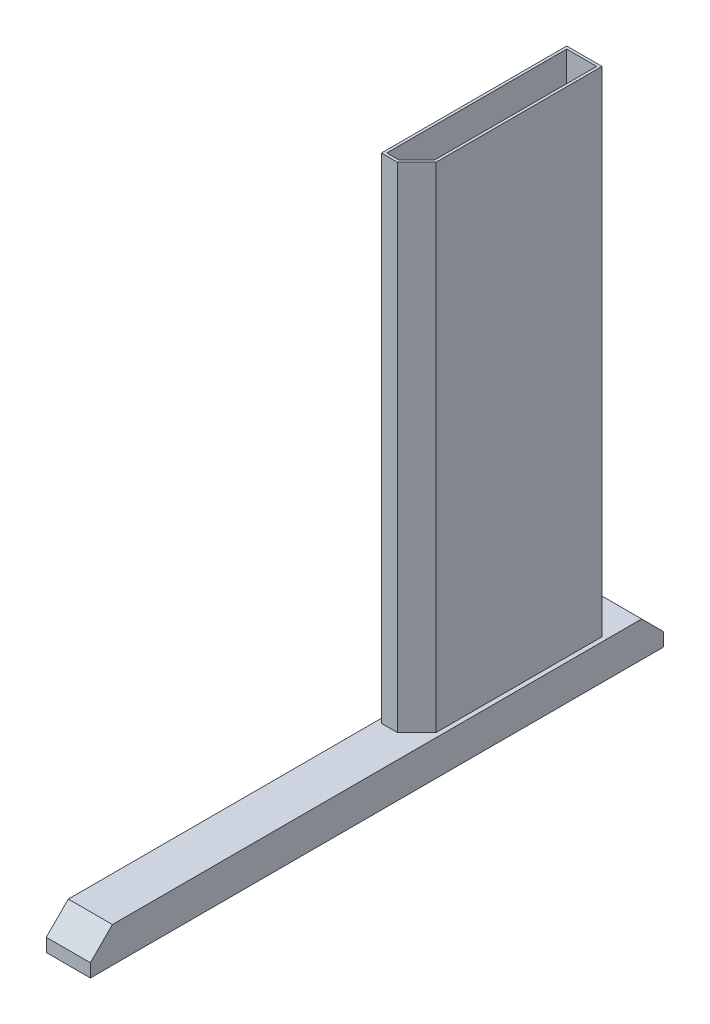
ISO-10303-21;
HEADER;
FILE_DESCRIPTION(('STEP AP214'),'2;1');
FILE_NAME('part.step','',(''),(''),'','','');
FILE_SCHEMA(('AUTOMOTIVE_DESIGN { 1 0 10303 214 1 1 1 1 }'));
ENDSEC;
DATA;
#1=APPLICATION_CONTEXT('core data for automotive mechanical design processes');
#2=APPLICATION_PROTOCOL_DEFINITION('international standard','automotive_design',2000,#1);
#3=PRODUCT_CONTEXT('',#1,'mechanical');
#4=PRODUCT('Part','Part','',(#3));
#5=PRODUCT_RELATED_PRODUCT_CATEGORY('part','',(#4));
#6=PRODUCT_DEFINITION_FORMATION('','',#4);
#7=PRODUCT_DEFINITION_CONTEXT('part definition',#1,'design');
#8=PRODUCT_DEFINITION('design','',#6,#7);
#9=PRODUCT_DEFINITION_SHAPE('','',#8);
#10=(LENGTH_UNIT() NAMED_UNIT(*) SI_UNIT(.MILLI.,.METRE.));
#11=(NAMED_UNIT(*) PLANE_ANGLE_UNIT() SI_UNIT($,.RADIAN.));
#12=(NAMED_UNIT(*) SI_UNIT($,.STERADIAN.) SOLID_ANGLE_UNIT());
#13=UNCERTAINTY_MEASURE_WITH_UNIT(LENGTH_MEASURE(1.E-05),#10,'distance_accuracy_value','');
#14=(GEOMETRIC_REPRESENTATION_CONTEXT(3) GLOBAL_UNCERTAINTY_ASSIGNED_CONTEXT((#13)) GLOBAL_UNIT_ASSIGNED_CONTEXT((#10,
#11,#12)) REPRESENTATION_CONTEXT('',''));
#15=CARTESIAN_POINT('',(0.,0.,0.));
#16=DIRECTION('',(0.,0.,1.));
#17=DIRECTION('',(1.,0.,0.));
#18=AXIS2_PLACEMENT_3D('',#15,#16,#17);
#19=CARTESIAN_POINT('',(50.,40.,300.));
#20=DIRECTION('',(0.,-1.,0.));
#21=DIRECTION('',(0.,0.,-1.));
#22=AXIS2_PLACEMENT_3D('',#19,#20,#21);
#23=PLANE('',#22);
#24=DIRECTION('',(0.,0.,-1.));
#25=VECTOR('',#24,1.);
#26=CARTESIAN_POINT('',(8.,40.,-50.));
#27=LINE('',#26,#25);
#28=CARTESIAN_POINT('',(8.,40.,-53.));
#29=VERTEX_POINT('',#28);
#30=CARTESIAN_POINT('',(8.,40.,-257.));
#31=VERTEX_POINT('',#30);
#32=EDGE_CURVE('E306',#29,#31,#27,.T.);
#33=ORIENTED_EDGE('',*,*,#32,.F.);
#34=DIRECTION('',(1.,0.,0.));
#35=VECTOR('',#34,1.);
#36=CARTESIAN_POINT('',(22.9289321881345,40.,-53.));
#37=LINE('',#36,#35);
#38=CARTESIAN_POINT('',(21.6862915010152,39.9999999999999,-53.));
#39=VERTEX_POINT('',#38);
#40=EDGE_CURVE('E318',#39,#29,#37,.F.);
#41=ORIENTED_EDGE('',*,*,#40,.F.);
#42=DIRECTION('',(-0.707106781186546,0.,0.707106781186549));
#43=VECTOR('',#42,1.);
#44=CARTESIAN_POINT('',(42.8786796564404,39.9999999999998,-74.1923881554252));
#45=LINE('',#44,#43);
#46=CARTESIAN_POINT('',(42.,39.9999999999999,-73.3137084989848));
#47=VERTEX_POINT('',#46);
#48=EDGE_CURVE('E137',#47,#39,#45,.T.);
#49=ORIENTED_EDGE('',*,*,#48,.F.);
#50=DIRECTION('',(0.,0.,1.));
#51=VECTOR('',#50,1.);
#52=CARTESIAN_POINT('',(42.,40.,-260.));
#53=LINE('',#52,#51);
#54=CARTESIAN_POINT('',(42.,40.,-257.));
#55=VERTEX_POINT('',#54);
#56=EDGE_CURVE('E131',#55,#47,#53,.T.);
#57=ORIENTED_EDGE('',*,*,#56,.F.);
#58=DIRECTION('',(1.,0.,0.));
#59=VECTOR('',#58,1.);
#60=CARTESIAN_POINT('',(5.,40.,-257.));
#61=LINE('',#60,#59);
#62=EDGE_CURVE('E310',#31,#55,#61,.T.);
#63=ORIENTED_EDGE('',*,*,#62,.F.);
#64=EDGE_LOOP('',(#33,#41,#49,#57,#63));
#65=FACE_BOUND('',#64,.T.);
#66=ADVANCED_FACE('F18',(#65),#23,.F.);
#67=CARTESIAN_POINT('',(50.,0.,325.));
#68=DIRECTION('',(0.,0.,-1.));
#69=DIRECTION('',(-1.,0.,0.));
#70=AXIS2_PLACEMENT_3D('',#67,#68,#69);
#71=PLANE('',#70);
#72=DIRECTION('',(1.,0.,0.));
#73=VECTOR('',#72,1.);
#74=CARTESIAN_POINT('',(50.,0.,325.));
#75=LINE('',#74,#73);
#76=CARTESIAN_POINT('',(0.,0.,325.));
#77=VERTEX_POINT('',#76);
#78=CARTESIAN_POINT('',(50.,0.,325.));
#79=VERTEX_POINT('',#78);
#80=EDGE_CURVE('E21',#77,#79,#75,.T.);
#81=ORIENTED_EDGE('',*,*,#80,.T.);
#82=DIRECTION('',(0.,1.,0.));
#83=VECTOR('',#82,1.);
#84=CARTESIAN_POINT('',(50.,40.,325.));
#85=LINE('',#84,#83);
#86=CARTESIAN_POINT('',(50.,15.,325.));
#87=VERTEX_POINT('',#86);
#88=EDGE_CURVE('E288',#79,#87,#85,.T.);
#89=ORIENTED_EDGE('',*,*,#88,.T.);
#90=DIRECTION('',(1.,0.,0.));
#91=VECTOR('',#90,1.);
#92=CARTESIAN_POINT('',(50.,15.,325.));
#93=LINE('',#92,#91);
#94=CARTESIAN_POINT('',(0.,15.,325.));
#95=VERTEX_POINT('',#94);
#96=EDGE_CURVE('E282',#87,#95,#93,.F.);
#97=ORIENTED_EDGE('',*,*,#96,.T.);
#98=DIRECTION('',(0.,1.,0.));
#99=VECTOR('',#98,1.);
#100=CARTESIAN_POINT('',(0.,40.,325.));
#101=LINE('',#100,#99);
#102=EDGE_CURVE('E280',#77,#95,#101,.T.);
#103=ORIENTED_EDGE('',*,*,#102,.F.);
#104=EDGE_LOOP('',(#81,#89,#97,#103));
#105=FACE_BOUND('',#104,.T.);
#106=ADVANCED_FACE('F456',(#105),#71,.F.);
#107=CARTESIAN_POINT('',(50.,15.,-325.));
#108=DIRECTION('',(0.,0.,1.));
#109=DIRECTION('',(1.,0.,0.));
#110=AXIS2_PLACEMENT_3D('',#107,#108,#109);
#111=PLANE('',#110);
#112=DIRECTION('',(1.,0.,0.));
#113=VECTOR('',#112,1.);
#114=CARTESIAN_POINT('',(50.,15.,-325.));
#115=LINE('',#114,#113);
#116=CARTESIAN_POINT('',(0.,15.,-325.));
#117=VERTEX_POINT('',#116);
#118=CARTESIAN_POINT('',(50.,15.,-325.));
#119=VERTEX_POINT('',#118);
#120=EDGE_CURVE('E299',#117,#119,#115,.T.);
#121=ORIENTED_EDGE('',*,*,#120,.T.);
#122=DIRECTION('',(0.,1.,0.));
#123=VECTOR('',#122,1.);
#124=CARTESIAN_POINT('',(50.,40.,-325.));
#125=LINE('',#124,#123);
#126=CARTESIAN_POINT('',(50.,0.,-325.));
#127=VERTEX_POINT('',#126);
#128=EDGE_CURVE('E293',#119,#127,#125,.F.);
#129=ORIENTED_EDGE('',*,*,#128,.T.);
#130=DIRECTION('',(1.,0.,0.));
#131=VECTOR('',#130,1.);
#132=CARTESIAN_POINT('',(50.,0.,-325.));
#133=LINE('',#132,#131);
#134=CARTESIAN_POINT('',(0.,0.,-325.));
#135=VERTEX_POINT('',#134);
#136=EDGE_CURVE('E319',#127,#135,#133,.F.);
#137=ORIENTED_EDGE('',*,*,#136,.T.);
#138=DIRECTION('',(0.,1.,0.));
#139=VECTOR('',#138,1.);
#140=CARTESIAN_POINT('',(0.,40.,-325.));
#141=LINE('',#140,#139);
#142=EDGE_CURVE('E273',#117,#135,#141,.F.);
#143=ORIENTED_EDGE('',*,*,#142,.F.);
#144=EDGE_LOOP('',(#121,#129,#137,#143));
#145=FACE_BOUND('',#144,.T.);
#146=ADVANCED_FACE('F453',(#145),#111,.F.);
#147=CARTESIAN_POINT('',(50.,0.,325.));
#148=DIRECTION('',(0.,1.,0.));
#149=DIRECTION('',(0.,0.,1.));
#150=AXIS2_PLACEMENT_3D('',#147,#148,#149);
#151=PLANE('',#150);
#152=ORIENTED_EDGE('',*,*,#136,.F.);
#153=DIRECTION('',(0.,0.,1.));
#154=VECTOR('',#153,1.);
#155=CARTESIAN_POINT('',(50.,0.,325.));
#156=LINE('',#155,#154);
#157=EDGE_CURVE('E290',#127,#79,#156,.T.);
#158=ORIENTED_EDGE('',*,*,#157,.T.);
#159=ORIENTED_EDGE('',*,*,#80,.F.);
#160=DIRECTION('',(0.,0.,1.));
#161=VECTOR('',#160,1.);
#162=CARTESIAN_POINT('',(0.,0.,325.));
#163=LINE('',#162,#161);
#164=EDGE_CURVE('E270',#135,#77,#163,.T.);
#165=ORIENTED_EDGE('',*,*,#164,.F.);
#166=EDGE_LOOP('',(#152,#158,#159,#165));
#167=FACE_BOUND('',#166,.T.);
#168=ADVANCED_FACE('F449',(#167),#151,.F.);
#169=CARTESIAN_POINT('',(22.9289321881345,600.,-53.));
#170=DIRECTION('',(0.,0.,-1.));
#171=DIRECTION('',(0.,1.,0.));
#172=AXIS2_PLACEMENT_3D('',#169,#170,#171);
#173=PLANE('',#172);
#174=DIRECTION('',(1.,0.,0.));
#175=VECTOR('',#174,1.);
#176=CARTESIAN_POINT('',(5.,600.,-53.));
#177=LINE('',#176,#175);
#178=CARTESIAN_POINT('',(8.,600.,-53.));
#179=VERTEX_POINT('',#178);
#180=CARTESIAN_POINT('',(21.6862915010152,600.,-53.));
#181=VERTEX_POINT('',#180);
#182=EDGE_CURVE('E255',#179,#181,#177,.T.);
#183=ORIENTED_EDGE('',*,*,#182,.T.);
#184=DIRECTION('',(0.,1.,0.));
#185=VECTOR('',#184,1.);
#186=CARTESIAN_POINT('',(21.6862915010152,600.,-53.));
#187=LINE('',#186,#185);
#188=EDGE_CURVE('E315',#39,#181,#187,.T.);
#189=ORIENTED_EDGE('',*,*,#188,.F.);
#190=ORIENTED_EDGE('',*,*,#40,.T.);
#191=DIRECTION('',(0.,1.,0.));
#192=VECTOR('',#191,1.);
#193=CARTESIAN_POINT('',(8.,600.,-53.));
#194=LINE('',#193,#192);
#195=EDGE_CURVE('E301',#179,#29,#194,.F.);
#196=ORIENTED_EDGE('',*,*,#195,.F.);
#197=EDGE_LOOP('',(#183,#189,#190,#196));
#198=FACE_BOUND('',#197,.T.);
#199=ADVANCED_FACE('F446',(#198),#173,.T.);
#200=CARTESIAN_POINT('',(42.8786796564404,600.,-74.1923881554252));
#201=DIRECTION('',(-0.707106781186549,0.,-0.707106781186546));
#202=DIRECTION('',(-0.707106781186546,0.,0.707106781186549));
#203=AXIS2_PLACEMENT_3D('',#200,#201,#202);
#204=PLANE('',#203);
#205=DIRECTION('',(0.707106781186546,0.,-0.707106781186549));
#206=VECTOR('',#205,1.);
#207=CARTESIAN_POINT('',(21.6862915010152,600.,-53.));
#208=LINE('',#207,#206);
#209=CARTESIAN_POINT('',(42.,600.,-73.3137084989848));
#210=VERTEX_POINT('',#209);
#211=EDGE_CURVE('E252',#181,#210,#208,.T.);
#212=ORIENTED_EDGE('',*,*,#211,.T.);
#213=DIRECTION('',(0.,1.,0.));
#214=VECTOR('',#213,1.);
#215=CARTESIAN_POINT('',(42.,600.,-73.3137084989848));
#216=LINE('',#215,#214);
#217=EDGE_CURVE('E312',#47,#210,#216,.T.);
#218=ORIENTED_EDGE('',*,*,#217,.F.);
#219=ORIENTED_EDGE('',*,*,#48,.T.);
#220=ORIENTED_EDGE('',*,*,#188,.T.);
#221=EDGE_LOOP('',(#212,#218,#219,#220));
#222=FACE_BOUND('',#221,.T.);
#223=ADVANCED_FACE('F443',(#222),#204,.T.);
#224=CARTESIAN_POINT('',(42.,600.,-260.));
#225=DIRECTION('',(-1.,0.,0.));
#226=DIRECTION('',(0.,0.,1.));
#227=AXIS2_PLACEMENT_3D('',#224,#225,#226);
#228=PLANE('',#227);
#229=DIRECTION('',(0.,0.,-1.));
#230=VECTOR('',#229,1.);
#231=CARTESIAN_POINT('',(42.,600.,-260.));
#232=LINE('',#231,#230);
#233=CARTESIAN_POINT('',(42.,600.,-257.));
#234=VERTEX_POINT('',#233);
#235=EDGE_CURVE('E249',#210,#234,#232,.T.);
#236=ORIENTED_EDGE('',*,*,#235,.T.);
#237=DIRECTION('',(0.,-1.,0.));
#238=VECTOR('',#237,1.);
#239=CARTESIAN_POINT('',(42.,600.,-257.));
#240=LINE('',#239,#238);
#241=EDGE_CURVE('E308',#55,#234,#240,.F.);
#242=ORIENTED_EDGE('',*,*,#241,.F.);
#243=ORIENTED_EDGE('',*,*,#56,.T.);
#244=ORIENTED_EDGE('',*,*,#217,.T.);
#245=EDGE_LOOP('',(#236,#242,#243,#244));
#246=FACE_BOUND('',#245,.T.);
#247=ADVANCED_FACE('F439',(#246),#228,.T.);
#248=CARTESIAN_POINT('',(5.,600.,-257.));
#249=DIRECTION('',(0.,0.,1.));
#250=DIRECTION('',(0.,-1.,0.));
#251=AXIS2_PLACEMENT_3D('',#248,#249,#250);
#252=PLANE('',#251);
#253=DIRECTION('',(1.,0.,0.));
#254=VECTOR('',#253,1.);
#255=CARTESIAN_POINT('',(5.,600.,-257.));
#256=LINE('',#255,#254);
#257=CARTESIAN_POINT('',(8.,600.,-257.));
#258=VERTEX_POINT('',#257);
#259=EDGE_CURVE('E246',#234,#258,#256,.F.);
#260=ORIENTED_EDGE('',*,*,#259,.T.);
#261=DIRECTION('',(0.,1.,0.));
#262=VECTOR('',#261,1.);
#263=CARTESIAN_POINT('',(8.,600.,-257.));
#264=LINE('',#263,#262);
#265=EDGE_CURVE('E304',#31,#258,#264,.T.);
#266=ORIENTED_EDGE('',*,*,#265,.F.);
#267=ORIENTED_EDGE('',*,*,#62,.T.);
#268=ORIENTED_EDGE('',*,*,#241,.T.);
#269=EDGE_LOOP('',(#260,#266,#267,#268));
#270=FACE_BOUND('',#269,.T.);
#271=ADVANCED_FACE('F435',(#270),#252,.T.);
#272=CARTESIAN_POINT('',(8.,600.,-50.));
#273=DIRECTION('',(1.,0.,0.));
#274=DIRECTION('',(0.,0.,-1.));
#275=AXIS2_PLACEMENT_3D('',#272,#273,#274);
#276=PLANE('',#275);
#277=DIRECTION('',(0.,0.,-1.));
#278=VECTOR('',#277,1.);
#279=CARTESIAN_POINT('',(8.,600.,-260.));
#280=LINE('',#279,#278);
#281=EDGE_CURVE('E243',#258,#179,#280,.F.);
#282=ORIENTED_EDGE('',*,*,#281,.T.);
#283=ORIENTED_EDGE('',*,*,#195,.T.);
#284=ORIENTED_EDGE('',*,*,#32,.T.);
#285=ORIENTED_EDGE('',*,*,#265,.T.);
#286=EDGE_LOOP('',(#282,#283,#284,#285));
#287=FACE_BOUND('',#286,.T.);
#288=ADVANCED_FACE('F431',(#287),#276,.T.);
#289=CARTESIAN_POINT('',(50.,40.,-300.));
#290=DIRECTION('',(0.,-0.707106781186547,0.707106781186548));
#291=DIRECTION('',(0.,-0.707106781186548,-0.707106781186547));
#292=AXIS2_PLACEMENT_3D('',#289,#290,#291);
#293=PLANE('',#292);
#294=DIRECTION('',(1.,0.,0.));
#295=VECTOR('',#294,1.);
#296=CARTESIAN_POINT('',(50.,40.,-300.));
#297=LINE('',#296,#295);
#298=CARTESIAN_POINT('',(0.,40.,-300.));
#299=VERTEX_POINT('',#298);
#300=CARTESIAN_POINT('',(50.,40.,-300.));
#301=VERTEX_POINT('',#300);
#302=EDGE_CURVE('E235',#299,#301,#297,.T.);
#303=ORIENTED_EDGE('',*,*,#302,.T.);
#304=DIRECTION('',(0.,-0.707106781186549,-0.707106781186546));
#305=VECTOR('',#304,1.);
#306=CARTESIAN_POINT('',(50.,40.,-300.));
#307=LINE('',#306,#305);
#308=EDGE_CURVE('E296',#301,#119,#307,.T.);
#309=ORIENTED_EDGE('',*,*,#308,.T.);
#310=ORIENTED_EDGE('',*,*,#120,.F.);
#311=DIRECTION('',(0.,-0.707106781186549,-0.707106781186546));
#312=VECTOR('',#311,1.);
#313=CARTESIAN_POINT('',(0.,40.,-300.));
#314=LINE('',#313,#312);
#315=EDGE_CURVE('E275',#299,#117,#314,.T.);
#316=ORIENTED_EDGE('',*,*,#315,.F.);
#317=EDGE_LOOP('',(#303,#309,#310,#316));
#318=FACE_BOUND('',#317,.T.);
#319=ADVANCED_FACE('F427',(#318),#293,.F.);
#320=CARTESIAN_POINT('',(50.,40.,325.));
#321=DIRECTION('',(-1.,0.,0.));
#322=DIRECTION('',(0.,0.,1.));
#323=AXIS2_PLACEMENT_3D('',#320,#321,#322);
#324=PLANE('',#323);
#325=ORIENTED_EDGE('',*,*,#157,.F.);
#326=ORIENTED_EDGE('',*,*,#128,.F.);
#327=ORIENTED_EDGE('',*,*,#308,.F.);
#328=DIRECTION('',(0.,0.,-1.));
#329=VECTOR('',#328,1.);
#330=CARTESIAN_POINT('',(50.,40.,300.));
#331=LINE('',#330,#329);
#332=CARTESIAN_POINT('',(50.,40.,300.));
#333=VERTEX_POINT('',#332);
#334=EDGE_CURVE('E232',#301,#333,#331,.F.);
#335=ORIENTED_EDGE('',*,*,#334,.T.);
#336=DIRECTION('',(0.,0.707106781186549,-0.707106781186546));
#337=VECTOR('',#336,1.);
#338=CARTESIAN_POINT('',(50.,15.,325.));
#339=LINE('',#338,#337);
#340=EDGE_CURVE('E285',#333,#87,#339,.F.);
#341=ORIENTED_EDGE('',*,*,#340,.T.);
#342=ORIENTED_EDGE('',*,*,#88,.F.);
#343=EDGE_LOOP('',(#325,#326,#327,#335,#341,#342));
#344=FACE_BOUND('',#343,.T.);
#345=ADVANCED_FACE('F423',(#344),#324,.F.);
#346=CARTESIAN_POINT('',(50.,15.,325.));
#347=DIRECTION('',(0.,-0.707106781186546,-0.707106781186549));
#348=DIRECTION('',(0.,0.707106781186549,-0.707106781186546));
#349=AXIS2_PLACEMENT_3D('',#346,#347,#348);
#350=PLANE('',#349);
#351=ORIENTED_EDGE('',*,*,#96,.F.);
#352=ORIENTED_EDGE('',*,*,#340,.F.);
#353=DIRECTION('',(1.,0.,0.));
#354=VECTOR('',#353,1.);
#355=CARTESIAN_POINT('',(50.,40.,300.));
#356=LINE('',#355,#354);
#357=CARTESIAN_POINT('',(0.,40.,300.));
#358=VERTEX_POINT('',#357);
#359=EDGE_CURVE('E229',#333,#358,#356,.F.);
#360=ORIENTED_EDGE('',*,*,#359,.T.);
#361=DIRECTION('',(0.,0.707106781186549,-0.707106781186546));
#362=VECTOR('',#361,1.);
#363=CARTESIAN_POINT('',(0.,15.,325.));
#364=LINE('',#363,#362);
#365=EDGE_CURVE('E278',#95,#358,#364,.T.);
#366=ORIENTED_EDGE('',*,*,#365,.F.);
#367=EDGE_LOOP('',(#351,#352,#360,#366));
#368=FACE_BOUND('',#367,.T.);
#369=ADVANCED_FACE('F419',(#368),#350,.F.);
#370=CARTESIAN_POINT('',(0.,40.,325.));
#371=DIRECTION('',(-1.,0.,0.));
#372=DIRECTION('',(0.,0.,1.));
#373=AXIS2_PLACEMENT_3D('',#370,#371,#372);
#374=PLANE('',#373);
#375=ORIENTED_EDGE('',*,*,#142,.T.);
#376=ORIENTED_EDGE('',*,*,#164,.T.);
#377=ORIENTED_EDGE('',*,*,#102,.T.);
#378=ORIENTED_EDGE('',*,*,#365,.T.);
#379=DIRECTION('',(0.,0.,-1.));
#380=VECTOR('',#379,1.);
#381=CARTESIAN_POINT('',(0.,40.,300.));
#382=LINE('',#381,#380);
#383=EDGE_CURVE('E226',#358,#299,#382,.T.);
#384=ORIENTED_EDGE('',*,*,#383,.T.);
#385=ORIENTED_EDGE('',*,*,#315,.T.);
#386=EDGE_LOOP('',(#375,#376,#377,#378,#384,#385));
#387=FACE_BOUND('',#386,.T.);
#388=ADVANCED_FACE('F415',(#387),#374,.T.);
#389=CARTESIAN_POINT('',(45.,600.,-72.0710678118655));
#390=DIRECTION('',(-0.707106781186549,0.,-0.707106781186546));
#391=DIRECTION('',(-0.707106781186546,0.,0.707106781186549));
#392=AXIS2_PLACEMENT_3D('',#389,#390,#391);
#393=PLANE('',#392);
#394=DIRECTION('',(0.,1.,0.));
#395=VECTOR('',#394,1.);
#396=CARTESIAN_POINT('',(45.,600.,-72.0710678118655));
#397=LINE('',#396,#395);
#398=CARTESIAN_POINT('',(45.,39.9999999999999,-72.0710678118655));
#399=VERTEX_POINT('',#398);
#400=CARTESIAN_POINT('',(45.,600.,-72.0710678118655));
#401=VERTEX_POINT('',#400);
#402=EDGE_CURVE('E268',#399,#401,#397,.T.);
#403=ORIENTED_EDGE('',*,*,#402,.T.);
#404=DIRECTION('',(-0.707106781186546,0.,0.707106781186549));
#405=VECTOR('',#404,1.);
#406=CARTESIAN_POINT('',(45.,600.,-72.0710678118656));
#407=LINE('',#406,#405);
#408=CARTESIAN_POINT('',(22.9289321881345,600.,-50.));
#409=VERTEX_POINT('',#408);
#410=EDGE_CURVE('E258',#401,#409,#407,.T.);
#411=ORIENTED_EDGE('',*,*,#410,.T.);
#412=DIRECTION('',(0.,1.,0.));
#413=VECTOR('',#412,1.);
#414=CARTESIAN_POINT('',(22.9289321881345,600.,-50.));
#415=LINE('',#414,#413);
#416=CARTESIAN_POINT('',(22.9289321881345,40.,-50.));
#417=VERTEX_POINT('',#416);
#418=EDGE_CURVE('E238',#409,#417,#415,.F.);
#419=ORIENTED_EDGE('',*,*,#418,.T.);
#420=DIRECTION('',(0.707106781186546,0.,-0.707106781186549));
#421=VECTOR('',#420,1.);
#422=CARTESIAN_POINT('',(22.9289321881346,40.,-50.));
#423=LINE('',#422,#421);
#424=EDGE_CURVE('E222',#417,#399,#423,.T.);
#425=ORIENTED_EDGE('',*,*,#424,.T.);
#426=EDGE_LOOP('',(#403,#411,#419,#425));
#427=FACE_BOUND('',#426,.T.);
#428=ADVANCED_FACE('F411',(#427),#393,.F.);
#429=CARTESIAN_POINT('',(45.,600.,-260.));
#430=DIRECTION('',(-1.,0.,0.));
#431=DIRECTION('',(0.,0.,1.));
#432=AXIS2_PLACEMENT_3D('',#429,#430,#431);
#433=PLANE('',#432);
#434=DIRECTION('',(0.,-1.,0.));
#435=VECTOR('',#434,1.);
#436=CARTESIAN_POINT('',(45.,600.,-260.));
#437=LINE('',#436,#435);
#438=CARTESIAN_POINT('',(45.,40.,-260.));
#439=VERTEX_POINT('',#438);
#440=CARTESIAN_POINT('',(45.,600.,-260.));
#441=VERTEX_POINT('',#440);
#442=EDGE_CURVE('E266',#439,#441,#437,.F.);
#443=ORIENTED_EDGE('',*,*,#442,.T.);
#444=DIRECTION('',(0.,0.,-1.));
#445=VECTOR('',#444,1.);
#446=CARTESIAN_POINT('',(45.,600.,-260.));
#447=LINE('',#446,#445);
#448=EDGE_CURVE('E260',#441,#401,#447,.F.);
#449=ORIENTED_EDGE('',*,*,#448,.T.);
#450=ORIENTED_EDGE('',*,*,#402,.F.);
#451=DIRECTION('',(0.,0.,-1.));
#452=VECTOR('',#451,1.);
#453=CARTESIAN_POINT('',(45.,40.,300.));
#454=LINE('',#453,#452);
#455=EDGE_CURVE('E219',#399,#439,#454,.T.);
#456=ORIENTED_EDGE('',*,*,#455,.T.);
#457=EDGE_LOOP('',(#443,#449,#450,#456));
#458=FACE_BOUND('',#457,.T.);
#459=ADVANCED_FACE('F407',(#458),#433,.F.);
#460=CARTESIAN_POINT('',(5.,600.,-260.));
#461=DIRECTION('',(0.,0.,1.));
#462=DIRECTION('',(0.,-1.,0.));
#463=AXIS2_PLACEMENT_3D('',#460,#461,#462);
#464=PLANE('',#463);
#465=DIRECTION('',(0.,1.,0.));
#466=VECTOR('',#465,1.);
#467=CARTESIAN_POINT('',(5.,600.,-260.));
#468=LINE('',#467,#466);
#469=CARTESIAN_POINT('',(5.,40.,-260.));
#470=VERTEX_POINT('',#469);
#471=CARTESIAN_POINT('',(5.,600.,-260.));
#472=VERTEX_POINT('',#471);
#473=EDGE_CURVE('E213',#470,#472,#468,.T.);
#474=ORIENTED_EDGE('',*,*,#473,.T.);
#475=DIRECTION('',(1.,0.,0.));
#476=VECTOR('',#475,1.);
#477=CARTESIAN_POINT('',(5.,600.,-260.));
#478=LINE('',#477,#476);
#479=EDGE_CURVE('E263',#472,#441,#478,.T.);
#480=ORIENTED_EDGE('',*,*,#479,.T.);
#481=ORIENTED_EDGE('',*,*,#442,.F.);
#482=DIRECTION('',(1.,0.,0.));
#483=VECTOR('',#482,1.);
#484=CARTESIAN_POINT('',(50.,40.,-260.));
#485=LINE('',#484,#483);
#486=EDGE_CURVE('E216',#439,#470,#485,.F.);
#487=ORIENTED_EDGE('',*,*,#486,.T.);
#488=EDGE_LOOP('',(#474,#480,#481,#487));
#489=FACE_BOUND('',#488,.T.);
#490=ADVANCED_FACE('F403',(#489),#464,.F.);
#491=CARTESIAN_POINT('',(5.,600.,-260.));
#492=DIRECTION('',(0.,-1.,0.));
#493=DIRECTION('',(0.,0.,-1.));
#494=AXIS2_PLACEMENT_3D('',#491,#492,#493);
#495=PLANE('',#494);
#496=ORIENTED_EDGE('',*,*,#259,.F.);
#497=ORIENTED_EDGE('',*,*,#235,.F.);
#498=ORIENTED_EDGE('',*,*,#211,.F.);
#499=ORIENTED_EDGE('',*,*,#182,.F.);
#500=ORIENTED_EDGE('',*,*,#281,.F.);
#501=EDGE_LOOP('',(#496,#497,#498,#499,#500));
#502=FACE_BOUND('',#501,.T.);
#503=DIRECTION('',(1.,0.,0.));
#504=VECTOR('',#503,1.);
#505=CARTESIAN_POINT('',(22.9289321881345,600.,-50.));
#506=LINE('',#505,#504);
#507=CARTESIAN_POINT('',(5.,600.,-50.));
#508=VERTEX_POINT('',#507);
#509=EDGE_CURVE('E240',#508,#409,#506,.T.);
#510=ORIENTED_EDGE('',*,*,#509,.T.);
#511=ORIENTED_EDGE('',*,*,#410,.F.);
#512=ORIENTED_EDGE('',*,*,#448,.F.);
#513=ORIENTED_EDGE('',*,*,#479,.F.);
#514=DIRECTION('',(0.,0.,-1.));
#515=VECTOR('',#514,1.);
#516=CARTESIAN_POINT('',(5.,600.,-50.));
#517=LINE('',#516,#515);
#518=EDGE_CURVE('E210',#472,#508,#517,.F.);
#519=ORIENTED_EDGE('',*,*,#518,.T.);
#520=EDGE_LOOP('',(#510,#511,#512,#513,#519));
#521=FACE_BOUND('',#520,.T.);
#522=ADVANCED_FACE('F399',(#502,#521),#495,.F.);
#523=CARTESIAN_POINT('',(22.9289321881345,600.,-50.));
#524=DIRECTION('',(0.,0.,-1.));
#525=DIRECTION('',(0.,1.,0.));
#526=AXIS2_PLACEMENT_3D('',#523,#524,#525);
#527=PLANE('',#526);
#528=ORIENTED_EDGE('',*,*,#418,.F.);
#529=ORIENTED_EDGE('',*,*,#509,.F.);
#530=DIRECTION('',(0.,1.,0.));
#531=VECTOR('',#530,1.);
#532=CARTESIAN_POINT('',(5.,600.,-50.));
#533=LINE('',#532,#531);
#534=CARTESIAN_POINT('',(5.,40.,-50.));
#535=VERTEX_POINT('',#534);
#536=EDGE_CURVE('E27',#508,#535,#533,.F.);
#537=ORIENTED_EDGE('',*,*,#536,.T.);
#538=DIRECTION('',(1.,0.,0.));
#539=VECTOR('',#538,1.);
#540=CARTESIAN_POINT('',(50.,40.,-50.));
#541=LINE('',#540,#539);
#542=EDGE_CURVE('E35',#535,#417,#541,.T.);
#543=ORIENTED_EDGE('',*,*,#542,.T.);
#544=EDGE_LOOP('',(#528,#529,#537,#543));
#545=FACE_BOUND('',#544,.T.);
#546=ADVANCED_FACE('F396',(#545),#527,.F.);
#547=CARTESIAN_POINT('',(50.,40.,300.));
#548=DIRECTION('',(0.,-1.,0.));
#549=DIRECTION('',(0.,0.,-1.));
#550=AXIS2_PLACEMENT_3D('',#547,#548,#549);
#551=PLANE('',#550);
#552=ORIENTED_EDGE('',*,*,#486,.F.);
#553=ORIENTED_EDGE('',*,*,#455,.F.);
#554=ORIENTED_EDGE('',*,*,#424,.F.);
#555=ORIENTED_EDGE('',*,*,#542,.F.);
#556=DIRECTION('',(0.,0.,-1.));
#557=VECTOR('',#556,1.);
#558=CARTESIAN_POINT('',(5.,40.,-50.));
#559=LINE('',#558,#557);
#560=EDGE_CURVE('E11',#535,#470,#559,.T.);
#561=ORIENTED_EDGE('',*,*,#560,.T.);
#562=EDGE_LOOP('',(#552,#553,#554,#555,#561));
#563=FACE_BOUND('',#562,.T.);
#564=ORIENTED_EDGE('',*,*,#359,.F.);
#565=ORIENTED_EDGE('',*,*,#334,.F.);
#566=ORIENTED_EDGE('',*,*,#302,.F.);
#567=ORIENTED_EDGE('',*,*,#383,.F.);
#568=EDGE_LOOP('',(#564,#565,#566,#567));
#569=FACE_BOUND('',#568,.T.);
#570=ADVANCED_FACE('F392',(#563,#569),#551,.F.);
#571=CARTESIAN_POINT('',(5.,600.,-50.));
#572=DIRECTION('',(1.,0.,0.));
#573=DIRECTION('',(0.,0.,-1.));
#574=AXIS2_PLACEMENT_3D('',#571,#572,#573);
#575=PLANE('',#574);
#576=ORIENTED_EDGE('',*,*,#536,.F.);
#577=ORIENTED_EDGE('',*,*,#518,.F.);
#578=ORIENTED_EDGE('',*,*,#473,.F.);
#579=ORIENTED_EDGE('',*,*,#560,.F.);
#580=EDGE_LOOP('',(#576,#577,#578,#579));
#581=FACE_BOUND('',#580,.T.);
#582=ADVANCED_FACE('F389',(#581),#575,.F.);
#583=CLOSED_SHELL('',(#66,#106,#146,#168,#199,#223,#247,#271,#288,#319,#345,#369,#388,#428,#459,
#490,#522,#546,#570,#582));
#584=CARTESIAN_POINT('',(50.,12.8786796564404,322.87867965644));
#585=DIRECTION('',(0.,-0.707106781186546,-0.707106781186549));
#586=DIRECTION('',(0.,0.707106781186549,-0.707106781186546));
#587=AXIS2_PLACEMENT_3D('',#584,#585,#586);
#588=PLANE('',#587);
#589=DIRECTION('',(0.,0.707106781186549,-0.707106781186546));
#590=VECTOR('',#589,1.);
#591=CARTESIAN_POINT('',(47.,13.7573593128807,322.));
#592=LINE('',#591,#590);
#593=CARTESIAN_POINT('',(47.,13.7573593128807,322.));
#594=VERTEX_POINT('',#593);
#595=CARTESIAN_POINT('',(47.,37.,298.757359312881));
#596=VERTEX_POINT('',#595);
#597=EDGE_CURVE('E351',#594,#596,#592,.T.);
#598=ORIENTED_EDGE('',*,*,#597,.F.);
#599=DIRECTION('',(-1.,0.,0.));
#600=VECTOR('',#599,1.);
#601=CARTESIAN_POINT('',(50.,13.7573593128807,322.));
#602=LINE('',#601,#600);
#603=CARTESIAN_POINT('',(2.99999999999999,13.7573593128807,322.));
#604=VERTEX_POINT('',#603);
#605=EDGE_CURVE('E188',#604,#594,#602,.F.);
#606=ORIENTED_EDGE('',*,*,#605,.F.);
#607=DIRECTION('',(0.,0.707106781186549,-0.707106781186546));
#608=VECTOR('',#607,1.);
#609=CARTESIAN_POINT('',(3.,13.7573593128807,322.));
#610=LINE('',#609,#608);
#611=CARTESIAN_POINT('',(2.99999999999998,37.,298.757359312881));
#612=VERTEX_POINT('',#611);
#613=EDGE_CURVE('E183',#604,#612,#610,.T.);
#614=ORIENTED_EDGE('',*,*,#613,.T.);
#615=DIRECTION('',(1.,0.,0.));
#616=VECTOR('',#615,1.);
#617=CARTESIAN_POINT('',(50.,37.,298.757359312881));
#618=LINE('',#617,#616);
#619=EDGE_CURVE('E186',#596,#612,#618,.F.);
#620=ORIENTED_EDGE('',*,*,#619,.F.);
#621=EDGE_LOOP('',(#598,#606,#614,#620));
#622=FACE_BOUND('',#621,.T.);
#623=ADVANCED_FACE('F185',(#622),#588,.T.);
#624=CARTESIAN_POINT('',(50.,37.,300.));
#625=DIRECTION('',(0.,-1.,0.));
#626=DIRECTION('',(0.,0.,-1.));
#627=AXIS2_PLACEMENT_3D('',#624,#625,#626);
#628=PLANE('',#627);
#629=DIRECTION('',(0.,0.,1.));
#630=VECTOR('',#629,1.);
#631=CARTESIAN_POINT('',(47.,37.,325.));
#632=LINE('',#631,#630);
#633=CARTESIAN_POINT('',(47.,37.,-298.757359312881));
#634=VERTEX_POINT('',#633);
#635=EDGE_CURVE('E195',#596,#634,#632,.F.);
#636=ORIENTED_EDGE('',*,*,#635,.F.);
#637=ORIENTED_EDGE('',*,*,#619,.T.);
#638=DIRECTION('',(0.,0.,1.));
#639=VECTOR('',#638,1.);
#640=CARTESIAN_POINT('',(3.,37.,325.));
#641=LINE('',#640,#639);
#642=CARTESIAN_POINT('',(3.,37.,-298.757359312881));
#643=VERTEX_POINT('',#642);
#644=EDGE_CURVE('E178',#612,#643,#641,.F.);
#645=ORIENTED_EDGE('',*,*,#644,.T.);
#646=DIRECTION('',(1.,0.,0.));
#647=VECTOR('',#646,1.);
#648=CARTESIAN_POINT('',(50.,37.,-298.757359312881));
#649=LINE('',#648,#647);
#650=EDGE_CURVE('E191',#634,#643,#649,.F.);
#651=ORIENTED_EDGE('',*,*,#650,.F.);
#652=EDGE_LOOP('',(#636,#637,#645,#651));
#653=FACE_BOUND('',#652,.T.);
#654=ADVANCED_FACE('F193',(#653),#628,.T.);
#655=CARTESIAN_POINT('',(50.,37.8786796564404,-297.87867965644));
#656=DIRECTION('',(0.,-0.707106781186547,0.707106781186548));
#657=DIRECTION('',(0.,-0.707106781186548,-0.707106781186547));
#658=AXIS2_PLACEMENT_3D('',#655,#656,#657);
#659=PLANE('',#658);
#660=DIRECTION('',(0.,-0.707106781186548,-0.707106781186546));
#661=VECTOR('',#660,1.);
#662=CARTESIAN_POINT('',(47.,37.,-298.757359312881));
#663=LINE('',#662,#661);
#664=CARTESIAN_POINT('',(47.,13.7573593128807,-322.));
#665=VERTEX_POINT('',#664);
#666=EDGE_CURVE('E348',#634,#665,#663,.T.);
#667=ORIENTED_EDGE('',*,*,#666,.F.);
#668=ORIENTED_EDGE('',*,*,#650,.T.);
#669=DIRECTION('',(0.,-0.707106781186548,-0.707106781186546));
#670=VECTOR('',#669,1.);
#671=CARTESIAN_POINT('',(3.,37.,-298.757359312881));
#672=LINE('',#671,#670);
#673=CARTESIAN_POINT('',(3.,13.7573593128807,-322.));
#674=VERTEX_POINT('',#673);
#675=EDGE_CURVE('E201',#643,#674,#672,.T.);
#676=ORIENTED_EDGE('',*,*,#675,.T.);
#677=DIRECTION('',(1.,0.,0.));
#678=VECTOR('',#677,1.);
#679=CARTESIAN_POINT('',(50.,13.7573593128807,-322.));
#680=LINE('',#679,#678);
#681=EDGE_CURVE('E341',#665,#674,#680,.F.);
#682=ORIENTED_EDGE('',*,*,#681,.F.);
#683=EDGE_LOOP('',(#667,#668,#676,#682));
#684=FACE_BOUND('',#683,.T.);
#685=ADVANCED_FACE('F364',(#684),#659,.T.);
#686=CARTESIAN_POINT('',(3.,40.,325.));
#687=DIRECTION('',(-1.,0.,0.));
#688=DIRECTION('',(0.,0.,1.));
#689=AXIS2_PLACEMENT_3D('',#686,#687,#688);
#690=PLANE('',#689);
#691=DIRECTION('',(0.,0.,1.));
#692=VECTOR('',#691,1.);
#693=CARTESIAN_POINT('',(3.,3.,325.));
#694=LINE('',#693,#692);
#695=CARTESIAN_POINT('',(3.,3.,-322.));
#696=VERTEX_POINT('',#695);
#697=CARTESIAN_POINT('',(3.,3.,322.));
#698=VERTEX_POINT('',#697);
#699=EDGE_CURVE('E339',#696,#698,#694,.T.);
#700=ORIENTED_EDGE('',*,*,#699,.F.);
#701=DIRECTION('',(0.,1.,0.));
#702=VECTOR('',#701,1.);
#703=CARTESIAN_POINT('',(3.,15.,-322.));
#704=LINE('',#703,#702);
#705=EDGE_CURVE('E345',#674,#696,#704,.F.);
#706=ORIENTED_EDGE('',*,*,#705,.F.);
#707=ORIENTED_EDGE('',*,*,#675,.F.);
#708=ORIENTED_EDGE('',*,*,#644,.F.);
#709=ORIENTED_EDGE('',*,*,#613,.F.);
#710=DIRECTION('',(0.,1.,0.));
#711=VECTOR('',#710,1.);
#712=CARTESIAN_POINT('',(3.,0.,322.));
#713=LINE('',#712,#711);
#714=EDGE_CURVE('E203',#698,#604,#713,.T.);
#715=ORIENTED_EDGE('',*,*,#714,.F.);
#716=EDGE_LOOP('',(#700,#706,#707,#708,#709,#715));
#717=FACE_BOUND('',#716,.T.);
#718=ADVANCED_FACE('F199',(#717),#690,.F.);
#719=CARTESIAN_POINT('',(50.,0.,322.));
#720=DIRECTION('',(0.,0.,-1.));
#721=DIRECTION('',(-1.,0.,0.));
#722=AXIS2_PLACEMENT_3D('',#719,#720,#721);
#723=PLANE('',#722);
#724=DIRECTION('',(0.,1.,0.));
#725=VECTOR('',#724,1.);
#726=CARTESIAN_POINT('',(47.,40.,322.));
#727=LINE('',#726,#725);
#728=CARTESIAN_POINT('',(47.,3.,322.));
#729=VERTEX_POINT('',#728);
#730=EDGE_CURVE('E353',#729,#594,#727,.T.);
#731=ORIENTED_EDGE('',*,*,#730,.F.);
#732=DIRECTION('',(1.,0.,0.));
#733=VECTOR('',#732,1.);
#734=CARTESIAN_POINT('',(50.,3.,322.));
#735=LINE('',#734,#733);
#736=EDGE_CURVE('E334',#698,#729,#735,.T.);
#737=ORIENTED_EDGE('',*,*,#736,.F.);
#738=ORIENTED_EDGE('',*,*,#714,.T.);
#739=ORIENTED_EDGE('',*,*,#605,.T.);
#740=EDGE_LOOP('',(#731,#737,#738,#739));
#741=FACE_BOUND('',#740,.T.);
#742=ADVANCED_FACE('F358',(#741),#723,.T.);
#743=CARTESIAN_POINT('',(47.,40.,325.));
#744=DIRECTION('',(-1.,0.,0.));
#745=DIRECTION('',(0.,0.,1.));
#746=AXIS2_PLACEMENT_3D('',#743,#744,#745);
#747=PLANE('',#746);
#748=DIRECTION('',(0.,1.,0.));
#749=VECTOR('',#748,1.);
#750=CARTESIAN_POINT('',(47.,15.,-322.));
#751=LINE('',#750,#749);
#752=CARTESIAN_POINT('',(47.,3.,-322.));
#753=VERTEX_POINT('',#752);
#754=EDGE_CURVE('E146',#753,#665,#751,.T.);
#755=ORIENTED_EDGE('',*,*,#754,.F.);
#756=DIRECTION('',(0.,0.,1.));
#757=VECTOR('',#756,1.);
#758=CARTESIAN_POINT('',(47.,3.,325.));
#759=LINE('',#758,#757);
#760=EDGE_CURVE('E329',#729,#753,#759,.F.);
#761=ORIENTED_EDGE('',*,*,#760,.F.);
#762=ORIENTED_EDGE('',*,*,#730,.T.);
#763=ORIENTED_EDGE('',*,*,#597,.T.);
#764=ORIENTED_EDGE('',*,*,#635,.T.);
#765=ORIENTED_EDGE('',*,*,#666,.T.);
#766=EDGE_LOOP('',(#755,#761,#762,#763,#764,#765));
#767=FACE_BOUND('',#766,.T.);
#768=ADVANCED_FACE('F365',(#767),#747,.T.);
#769=CARTESIAN_POINT('',(50.,15.,-322.));
#770=DIRECTION('',(0.,0.,1.));
#771=DIRECTION('',(1.,0.,0.));
#772=AXIS2_PLACEMENT_3D('',#769,#770,#771);
#773=PLANE('',#772);
#774=ORIENTED_EDGE('',*,*,#754,.T.);
#775=ORIENTED_EDGE('',*,*,#681,.T.);
#776=ORIENTED_EDGE('',*,*,#705,.T.);
#777=DIRECTION('',(1.,0.,0.));
#778=VECTOR('',#777,1.);
#779=CARTESIAN_POINT('',(50.,3.,-322.));
#780=LINE('',#779,#778);
#781=EDGE_CURVE('E324',#753,#696,#780,.F.);
#782=ORIENTED_EDGE('',*,*,#781,.F.);
#783=EDGE_LOOP('',(#774,#775,#776,#782));
#784=FACE_BOUND('',#783,.T.);
#785=ADVANCED_FACE('F360',(#784),#773,.T.);
#786=CARTESIAN_POINT('',(50.,3.,325.));
#787=DIRECTION('',(0.,1.,0.));
#788=DIRECTION('',(0.,0.,1.));
#789=AXIS2_PLACEMENT_3D('',#786,#787,#788);
#790=PLANE('',#789);
#791=ORIENTED_EDGE('',*,*,#760,.T.);
#792=ORIENTED_EDGE('',*,*,#781,.T.);
#793=ORIENTED_EDGE('',*,*,#699,.T.);
#794=ORIENTED_EDGE('',*,*,#736,.T.);
#795=EDGE_LOOP('',(#791,#792,#793,#794));
#796=FACE_BOUND('',#795,.T.);
#797=ADVANCED_FACE('F366',(#796),#790,.T.);
#798=CLOSED_SHELL('',(#623,#654,#685,#718,#742,#768,#785,#797));
#799=ORIENTED_CLOSED_SHELL('',*,#798,.T.);
#800=BREP_WITH_VOIDS('B1',#583,(#799));
#801=ADVANCED_BREP_SHAPE_REPRESENTATION('',(#18,#800),#14);
#802=SHAPE_DEFINITION_REPRESENTATION(#9,#801);
ENDSEC;
END-ISO-10303-21;
